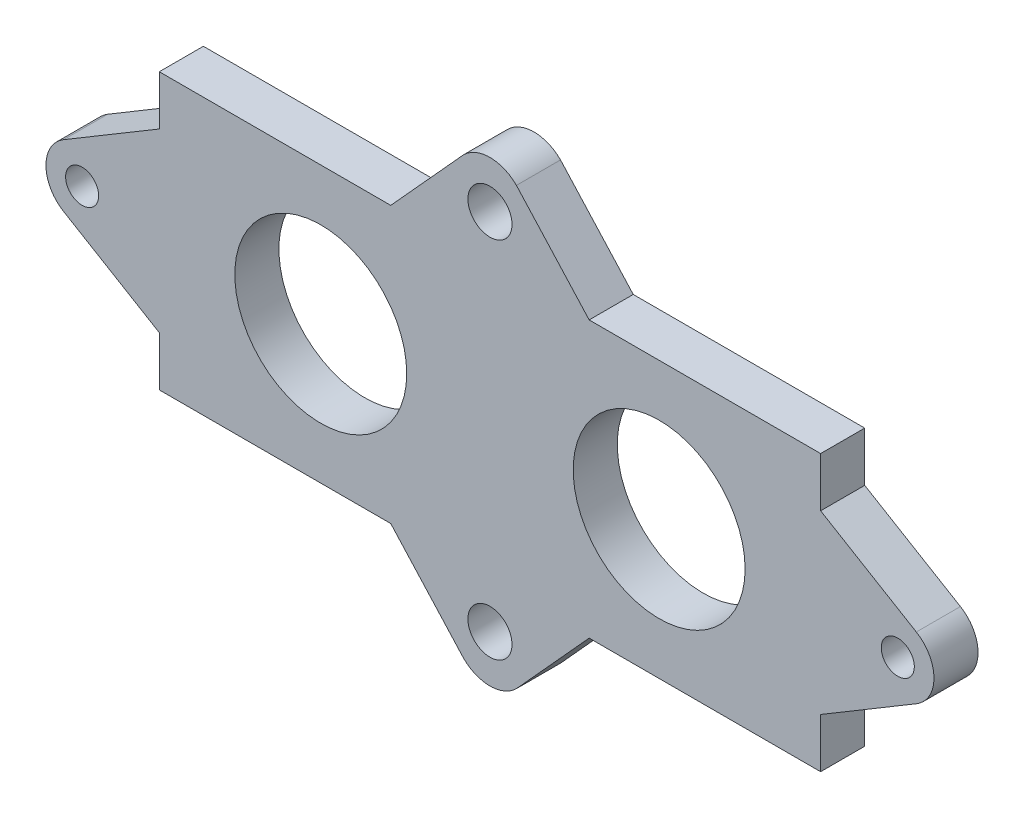
ISO-10303-21;
HEADER;
FILE_DESCRIPTION(('STEP AP214'),'2;1');
FILE_NAME('part.step','',(''),(''),'','','');
FILE_SCHEMA(('AUTOMOTIVE_DESIGN { 1 0 10303 214 1 1 1 1 }'));
ENDSEC;
DATA;
#1=APPLICATION_CONTEXT('core data for automotive mechanical design processes');
#2=APPLICATION_PROTOCOL_DEFINITION('international standard','automotive_design',2000,#1);
#3=PRODUCT_CONTEXT('',#1,'mechanical');
#4=PRODUCT('Part','Part','',(#3));
#5=PRODUCT_RELATED_PRODUCT_CATEGORY('part','',(#4));
#6=PRODUCT_DEFINITION_FORMATION('','',#4);
#7=PRODUCT_DEFINITION_CONTEXT('part definition',#1,'design');
#8=PRODUCT_DEFINITION('design','',#6,#7);
#9=PRODUCT_DEFINITION_SHAPE('','',#8);
#10=(LENGTH_UNIT() NAMED_UNIT(*) SI_UNIT(.MILLI.,.METRE.));
#11=(NAMED_UNIT(*) PLANE_ANGLE_UNIT() SI_UNIT($,.RADIAN.));
#12=(NAMED_UNIT(*) SI_UNIT($,.STERADIAN.) SOLID_ANGLE_UNIT());
#13=UNCERTAINTY_MEASURE_WITH_UNIT(LENGTH_MEASURE(1.E-05),#10,'distance_accuracy_value','');
#14=(GEOMETRIC_REPRESENTATION_CONTEXT(3) GLOBAL_UNCERTAINTY_ASSIGNED_CONTEXT((#13)) GLOBAL_UNIT_ASSIGNED_CONTEXT((#10,
#11,#12)) REPRESENTATION_CONTEXT('',''));
#15=CARTESIAN_POINT('',(0.,0.,0.));
#16=DIRECTION('',(0.,0.,1.));
#17=DIRECTION('',(1.,0.,0.));
#18=AXIS2_PLACEMENT_3D('',#15,#16,#17);
#19=CARTESIAN_POINT('',(-37.,0.,4.));
#20=DIRECTION('',(0.,0.,-1.));
#21=DIRECTION('',(-1.,0.,0.));
#22=AXIS2_PLACEMENT_3D('',#19,#20,#21);
#23=PLANE('',#22);
#24=DIRECTION('',(0.,-1.,0.));
#25=VECTOR('',#24,1.);
#26=CARTESIAN_POINT('',(-30.,12.5,4.));
#27=LINE('',#26,#25);
#28=CARTESIAN_POINT('',(-30.,12.5,4.));
#29=VERTEX_POINT('',#28);
#30=CARTESIAN_POINT('',(-30.,8.,4.));
#31=VERTEX_POINT('',#30);
#32=EDGE_CURVE('E242',#29,#31,#27,.T.);
#33=ORIENTED_EDGE('',*,*,#32,.T.);
#34=DIRECTION('',(-0.858790826671179,-0.512326376468588,0.));
#35=VECTOR('',#34,1.);
#36=CARTESIAN_POINT('',(-38.6825013268052,2.82030512518618,4.));
#37=LINE('',#36,#35);
#38=CARTESIAN_POINT('',(-38.6825013268052,2.82030512518618,4.));
#39=VERTEX_POINT('',#38);
#40=EDGE_CURVE('E130',#31,#39,#37,.T.);
#41=ORIENTED_EDGE('',*,*,#40,.T.);
#42=CARTESIAN_POINT('',(-37.,0.,4.));
#43=DIRECTION('',(0.,0.,1.));
#44=DIRECTION('',(-1.,0.,0.));
#45=AXIS2_PLACEMENT_3D('',#42,#43,#44);
#46=CIRCLE('',#45,3.28404197808932);
#47=CARTESIAN_POINT('',(-38.6825013268052,-2.82030512518618,4.));
#48=VERTEX_POINT('',#47);
#49=EDGE_CURVE('E293',#39,#48,#46,.T.);
#50=ORIENTED_EDGE('',*,*,#49,.T.);
#51=DIRECTION('',(0.858790826671179,-0.512326376468588,0.));
#52=VECTOR('',#51,1.);
#53=CARTESIAN_POINT('',(-30.,-8.,4.));
#54=LINE('',#53,#52);
#55=CARTESIAN_POINT('',(-30.,-8.,4.));
#56=VERTEX_POINT('',#55);
#57=EDGE_CURVE('E312',#48,#56,#54,.T.);
#58=ORIENTED_EDGE('',*,*,#57,.T.);
#59=DIRECTION('',(0.,-1.,0.));
#60=VECTOR('',#59,1.);
#61=CARTESIAN_POINT('',(-30.,-8.,4.));
#62=LINE('',#61,#60);
#63=CARTESIAN_POINT('',(-30.,-12.5,4.));
#64=VERTEX_POINT('',#63);
#65=EDGE_CURVE('E309',#56,#64,#62,.T.);
#66=ORIENTED_EDGE('',*,*,#65,.T.);
#67=DIRECTION('',(1.,0.,0.));
#68=VECTOR('',#67,1.);
#69=CARTESIAN_POINT('',(-30.,-12.5,4.));
#70=LINE('',#69,#68);
#71=CARTESIAN_POINT('',(-9.,-12.5,4.));
#72=VERTEX_POINT('',#71);
#73=EDGE_CURVE('E311',#64,#72,#70,.T.);
#74=ORIENTED_EDGE('',*,*,#73,.T.);
#75=DIRECTION('',(0.671988671110962,-0.740561426148111,0.));
#76=VECTOR('',#75,1.);
#77=CARTESIAN_POINT('',(-9.,-12.5,4.));
#78=LINE('',#77,#76);
#79=CARTESIAN_POINT('',(-2.4010102843855,-19.772380391254,4.));
#80=VERTEX_POINT('',#79);
#81=EDGE_CURVE('E314',#72,#80,#78,.T.);
#82=ORIENTED_EDGE('',*,*,#81,.T.);
#83=CARTESIAN_POINT('',(0.,-17.3713701068685,4.));
#84=DIRECTION('',(0.,0.,1.));
#85=DIRECTION('',(1.,0.,0.));
#86=AXIS2_PLACEMENT_3D('',#83,#84,#85);
#87=CIRCLE('',#86,3.39554130757526);
#88=CARTESIAN_POINT('',(2.4010102843855,-19.772380391254,4.));
#89=VERTEX_POINT('',#88);
#90=EDGE_CURVE('E320',#80,#89,#87,.T.);
#91=ORIENTED_EDGE('',*,*,#90,.T.);
#92=DIRECTION('',(0.671988671110962,0.740561426148111,0.));
#93=VECTOR('',#92,1.);
#94=CARTESIAN_POINT('',(2.4010102843855,-19.772380391254,4.));
#95=LINE('',#94,#93);
#96=CARTESIAN_POINT('',(9.,-12.5,4.));
#97=VERTEX_POINT('',#96);
#98=EDGE_CURVE('E322',#89,#97,#95,.T.);
#99=ORIENTED_EDGE('',*,*,#98,.T.);
#100=DIRECTION('',(1.,0.,0.));
#101=VECTOR('',#100,1.);
#102=CARTESIAN_POINT('',(9.,-12.5,4.));
#103=LINE('',#102,#101);
#104=CARTESIAN_POINT('',(30.,-12.5,4.));
#105=VERTEX_POINT('',#104);
#106=EDGE_CURVE('E324',#97,#105,#103,.T.);
#107=ORIENTED_EDGE('',*,*,#106,.T.);
#108=DIRECTION('',(0.,1.,0.));
#109=VECTOR('',#108,1.);
#110=CARTESIAN_POINT('',(30.,-8.,4.));
#111=LINE('',#110,#109);
#112=CARTESIAN_POINT('',(30.,-8.,4.));
#113=VERTEX_POINT('',#112);
#114=EDGE_CURVE('E326',#105,#113,#111,.T.);
#115=ORIENTED_EDGE('',*,*,#114,.T.);
#116=DIRECTION('',(0.858790826671179,0.512326376468588,0.));
#117=VECTOR('',#116,1.);
#118=CARTESIAN_POINT('',(30.,-8.,4.));
#119=LINE('',#118,#117);
#120=CARTESIAN_POINT('',(38.6825013268052,-2.82030512518618,4.));
#121=VERTEX_POINT('',#120);
#122=EDGE_CURVE('E328',#113,#121,#119,.T.);
#123=ORIENTED_EDGE('',*,*,#122,.T.);
#124=CARTESIAN_POINT('',(37.,0.,4.));
#125=DIRECTION('',(0.,0.,1.));
#126=DIRECTION('',(1.,0.,0.));
#127=AXIS2_PLACEMENT_3D('',#124,#125,#126);
#128=CIRCLE('',#127,3.28404197808932);
#129=CARTESIAN_POINT('',(38.6825013268052,2.82030512518618,4.));
#130=VERTEX_POINT('',#129);
#131=EDGE_CURVE('E330',#121,#130,#128,.T.);
#132=ORIENTED_EDGE('',*,*,#131,.T.);
#133=DIRECTION('',(-0.858790826671179,0.512326376468588,0.));
#134=VECTOR('',#133,1.);
#135=CARTESIAN_POINT('',(38.6825013268052,2.82030512518618,4.));
#136=LINE('',#135,#134);
#137=CARTESIAN_POINT('',(30.,8.,4.));
#138=VERTEX_POINT('',#137);
#139=EDGE_CURVE('E332',#130,#138,#136,.T.);
#140=ORIENTED_EDGE('',*,*,#139,.T.);
#141=DIRECTION('',(0.,1.,0.));
#142=VECTOR('',#141,1.);
#143=CARTESIAN_POINT('',(30.,12.5,4.));
#144=LINE('',#143,#142);
#145=CARTESIAN_POINT('',(30.,12.5,4.));
#146=VERTEX_POINT('',#145);
#147=EDGE_CURVE('E334',#138,#146,#144,.T.);
#148=ORIENTED_EDGE('',*,*,#147,.T.);
#149=DIRECTION('',(-1.,0.,0.));
#150=VECTOR('',#149,1.);
#151=CARTESIAN_POINT('',(9.,12.5,4.));
#152=LINE('',#151,#150);
#153=CARTESIAN_POINT('',(9.,12.5,4.));
#154=VERTEX_POINT('',#153);
#155=EDGE_CURVE('E336',#146,#154,#152,.T.);
#156=ORIENTED_EDGE('',*,*,#155,.T.);
#157=DIRECTION('',(-0.671988671110962,0.740561426148111,0.));
#158=VECTOR('',#157,1.);
#159=CARTESIAN_POINT('',(2.4010102843855,19.772380391254,4.));
#160=LINE('',#159,#158);
#161=CARTESIAN_POINT('',(2.4010102843855,19.772380391254,4.));
#162=VERTEX_POINT('',#161);
#163=EDGE_CURVE('E185',#154,#162,#160,.T.);
#164=ORIENTED_EDGE('',*,*,#163,.T.);
#165=CARTESIAN_POINT('',(0.,17.3713701068685,4.));
#166=DIRECTION('',(0.,0.,1.));
#167=DIRECTION('',(-1.,0.,0.));
#168=AXIS2_PLACEMENT_3D('',#165,#166,#167);
#169=CIRCLE('',#168,3.39554130757526);
#170=CARTESIAN_POINT('',(-2.4010102843855,19.772380391254,4.));
#171=VERTEX_POINT('',#170);
#172=EDGE_CURVE('E179',#162,#171,#169,.T.);
#173=ORIENTED_EDGE('',*,*,#172,.T.);
#174=DIRECTION('',(-0.671988671110962,-0.740561426148111,0.));
#175=VECTOR('',#174,1.);
#176=CARTESIAN_POINT('',(-9.,12.5,4.));
#177=LINE('',#176,#175);
#178=CARTESIAN_POINT('',(-9.,12.5,4.));
#179=VERTEX_POINT('',#178);
#180=EDGE_CURVE('E183',#171,#179,#177,.T.);
#181=ORIENTED_EDGE('',*,*,#180,.T.);
#182=DIRECTION('',(-1.,0.,0.));
#183=VECTOR('',#182,1.);
#184=CARTESIAN_POINT('',(-30.,12.5,4.));
#185=LINE('',#184,#183);
#186=EDGE_CURVE('E51',#179,#29,#185,.T.);
#187=ORIENTED_EDGE('',*,*,#186,.T.);
#188=EDGE_LOOP('',(#33,#41,#50,#58,#66,#74,#82,#91,#99,#107,#115,#123,#132,#140,#148,#156,#164,
#173,#181,#187));
#189=FACE_BOUND('',#188,.T.);
#190=CARTESIAN_POINT('',(-15.35,0.,4.));
#191=DIRECTION('',(0.,0.,1.));
#192=DIRECTION('',(1.,0.,0.));
#193=AXIS2_PLACEMENT_3D('',#190,#191,#192);
#194=CIRCLE('',#193,7.8);
#195=CARTESIAN_POINT('',(-7.55,0.,4.));
#196=VERTEX_POINT('',#195);
#197=EDGE_CURVE('E207',#196,#196,#194,.T.);
#198=ORIENTED_EDGE('',*,*,#197,.F.);
#199=EDGE_LOOP('',(#198));
#200=FACE_BOUND('',#199,.T.);
#201=CARTESIAN_POINT('',(15.35,0.,4.));
#202=DIRECTION('',(0.,0.,1.));
#203=DIRECTION('',(1.,0.,0.));
#204=AXIS2_PLACEMENT_3D('',#201,#202,#203);
#205=CIRCLE('',#204,7.80000000000001);
#206=CARTESIAN_POINT('',(23.15,0.,4.));
#207=VERTEX_POINT('',#206);
#208=EDGE_CURVE('E420',#207,#207,#205,.T.);
#209=ORIENTED_EDGE('',*,*,#208,.F.);
#210=EDGE_LOOP('',(#209));
#211=FACE_BOUND('',#210,.T.);
#212=CARTESIAN_POINT('',(0.,16.5,4.));
#213=DIRECTION('',(0.,0.,1.));
#214=DIRECTION('',(1.,0.,0.));
#215=AXIS2_PLACEMENT_3D('',#212,#213,#214);
#216=CIRCLE('',#215,2.);
#217=CARTESIAN_POINT('',(2.,16.5,4.));
#218=VERTEX_POINT('',#217);
#219=EDGE_CURVE('E414',#218,#218,#216,.T.);
#220=ORIENTED_EDGE('',*,*,#219,.F.);
#221=EDGE_LOOP('',(#220));
#222=FACE_BOUND('',#221,.T.);
#223=CARTESIAN_POINT('',(0.,-16.5,4.));
#224=DIRECTION('',(0.,0.,1.));
#225=DIRECTION('',(-1.,0.,0.));
#226=AXIS2_PLACEMENT_3D('',#223,#224,#225);
#227=CIRCLE('',#226,2.);
#228=CARTESIAN_POINT('',(-2.,-16.5,4.));
#229=VERTEX_POINT('',#228);
#230=EDGE_CURVE('E408',#229,#229,#227,.T.);
#231=ORIENTED_EDGE('',*,*,#230,.F.);
#232=EDGE_LOOP('',(#231));
#233=FACE_BOUND('',#232,.T.);
#234=CARTESIAN_POINT('',(-37.,0.,4.));
#235=DIRECTION('',(0.,0.,1.));
#236=DIRECTION('',(1.,0.,0.));
#237=AXIS2_PLACEMENT_3D('',#234,#235,#236);
#238=CIRCLE('',#237,1.5);
#239=CARTESIAN_POINT('',(-35.5,0.,4.));
#240=VERTEX_POINT('',#239);
#241=EDGE_CURVE('E402',#240,#240,#238,.T.);
#242=ORIENTED_EDGE('',*,*,#241,.F.);
#243=EDGE_LOOP('',(#242));
#244=FACE_BOUND('',#243,.T.);
#245=CARTESIAN_POINT('',(37.,0.,4.));
#246=DIRECTION('',(0.,0.,1.));
#247=DIRECTION('',(-1.,0.,0.));
#248=AXIS2_PLACEMENT_3D('',#245,#246,#247);
#249=CIRCLE('',#248,1.5);
#250=CARTESIAN_POINT('',(35.5,0.,4.));
#251=VERTEX_POINT('',#250);
#252=EDGE_CURVE('E393',#251,#251,#249,.T.);
#253=ORIENTED_EDGE('',*,*,#252,.F.);
#254=EDGE_LOOP('',(#253));
#255=FACE_BOUND('',#254,.T.);
#256=ADVANCED_FACE('F34',(#189,#200,#211,#222,#233,#244,#255),#23,.F.);
#257=CARTESIAN_POINT('',(-37.,0.,0.));
#258=DIRECTION('',(0.,0.,-1.));
#259=DIRECTION('',(-1.,0.,0.));
#260=AXIS2_PLACEMENT_3D('',#257,#258,#259);
#261=PLANE('',#260);
#262=CARTESIAN_POINT('',(-37.,0.,0.));
#263=DIRECTION('',(0.,0.,1.));
#264=DIRECTION('',(1.,0.,0.));
#265=AXIS2_PLACEMENT_3D('',#262,#263,#264);
#266=CIRCLE('',#265,1.5);
#267=CARTESIAN_POINT('',(-35.5,0.,0.));
#268=VERTEX_POINT('',#267);
#269=EDGE_CURVE('E399',#268,#268,#266,.T.);
#270=ORIENTED_EDGE('',*,*,#269,.T.);
#271=EDGE_LOOP('',(#270));
#272=FACE_BOUND('',#271,.T.);
#273=CARTESIAN_POINT('',(0.,16.5,0.));
#274=DIRECTION('',(0.,0.,1.));
#275=DIRECTION('',(1.,0.,0.));
#276=AXIS2_PLACEMENT_3D('',#273,#274,#275);
#277=CIRCLE('',#276,2.);
#278=CARTESIAN_POINT('',(2.,16.5,0.));
#279=VERTEX_POINT('',#278);
#280=EDGE_CURVE('E411',#279,#279,#277,.T.);
#281=ORIENTED_EDGE('',*,*,#280,.T.);
#282=EDGE_LOOP('',(#281));
#283=FACE_BOUND('',#282,.T.);
#284=CARTESIAN_POINT('',(-15.35,0.,0.));
#285=DIRECTION('',(0.,0.,1.));
#286=DIRECTION('',(1.,0.,0.));
#287=AXIS2_PLACEMENT_3D('',#284,#285,#286);
#288=CIRCLE('',#287,7.8);
#289=CARTESIAN_POINT('',(-7.55,0.,0.));
#290=VERTEX_POINT('',#289);
#291=EDGE_CURVE('E423',#290,#290,#288,.T.);
#292=ORIENTED_EDGE('',*,*,#291,.T.);
#293=EDGE_LOOP('',(#292));
#294=FACE_BOUND('',#293,.T.);
#295=DIRECTION('',(0.,-1.,0.));
#296=VECTOR('',#295,1.);
#297=CARTESIAN_POINT('',(-30.,12.5,0.));
#298=LINE('',#297,#296);
#299=CARTESIAN_POINT('',(-30.,12.5,0.));
#300=VERTEX_POINT('',#299);
#301=CARTESIAN_POINT('',(-30.,8.,0.));
#302=VERTEX_POINT('',#301);
#303=EDGE_CURVE('E203',#300,#302,#298,.T.);
#304=ORIENTED_EDGE('',*,*,#303,.F.);
#305=DIRECTION('',(-1.,0.,0.));
#306=VECTOR('',#305,1.);
#307=CARTESIAN_POINT('',(-30.,12.5,0.));
#308=LINE('',#307,#306);
#309=CARTESIAN_POINT('',(-9.,12.5,0.));
#310=VERTEX_POINT('',#309);
#311=EDGE_CURVE('E122',#310,#300,#308,.T.);
#312=ORIENTED_EDGE('',*,*,#311,.F.);
#313=DIRECTION('',(-0.671988671110962,-0.740561426148111,0.));
#314=VECTOR('',#313,1.);
#315=CARTESIAN_POINT('',(-9.,12.5,0.));
#316=LINE('',#315,#314);
#317=CARTESIAN_POINT('',(-2.4010102843855,19.772380391254,0.));
#318=VERTEX_POINT('',#317);
#319=EDGE_CURVE('E116',#318,#310,#316,.T.);
#320=ORIENTED_EDGE('',*,*,#319,.F.);
#321=CARTESIAN_POINT('',(0.,17.3713701068685,0.));
#322=DIRECTION('',(0.,0.,1.));
#323=DIRECTION('',(-1.,0.,0.));
#324=AXIS2_PLACEMENT_3D('',#321,#322,#323);
#325=CIRCLE('',#324,3.39554130757526);
#326=CARTESIAN_POINT('',(2.4010102843855,19.772380391254,0.));
#327=VERTEX_POINT('',#326);
#328=EDGE_CURVE('E193',#327,#318,#325,.T.);
#329=ORIENTED_EDGE('',*,*,#328,.F.);
#330=DIRECTION('',(-0.671988671110962,0.740561426148111,0.));
#331=VECTOR('',#330,1.);
#332=CARTESIAN_POINT('',(2.4010102843855,19.772380391254,0.));
#333=LINE('',#332,#331);
#334=CARTESIAN_POINT('',(9.,12.5,0.));
#335=VERTEX_POINT('',#334);
#336=EDGE_CURVE('E237',#335,#327,#333,.T.);
#337=ORIENTED_EDGE('',*,*,#336,.F.);
#338=DIRECTION('',(-1.,0.,0.));
#339=VECTOR('',#338,1.);
#340=CARTESIAN_POINT('',(9.,12.5,0.));
#341=LINE('',#340,#339);
#342=CARTESIAN_POINT('',(30.,12.5,0.));
#343=VERTEX_POINT('',#342);
#344=EDGE_CURVE('E235',#343,#335,#341,.T.);
#345=ORIENTED_EDGE('',*,*,#344,.F.);
#346=DIRECTION('',(0.,1.,0.));
#347=VECTOR('',#346,1.);
#348=CARTESIAN_POINT('',(30.,12.5,0.));
#349=LINE('',#348,#347);
#350=CARTESIAN_POINT('',(30.,8.,0.));
#351=VERTEX_POINT('',#350);
#352=EDGE_CURVE('E233',#351,#343,#349,.T.);
#353=ORIENTED_EDGE('',*,*,#352,.F.);
#354=DIRECTION('',(-0.858790826671179,0.512326376468588,0.));
#355=VECTOR('',#354,1.);
#356=CARTESIAN_POINT('',(38.6825013268052,2.82030512518618,0.));
#357=LINE('',#356,#355);
#358=CARTESIAN_POINT('',(38.6825013268052,2.82030512518618,0.));
#359=VERTEX_POINT('',#358);
#360=EDGE_CURVE('E231',#359,#351,#357,.T.);
#361=ORIENTED_EDGE('',*,*,#360,.F.);
#362=CARTESIAN_POINT('',(37.,0.,0.));
#363=DIRECTION('',(0.,0.,1.));
#364=DIRECTION('',(1.,0.,0.));
#365=AXIS2_PLACEMENT_3D('',#362,#363,#364);
#366=CIRCLE('',#365,3.28404197808932);
#367=CARTESIAN_POINT('',(38.6825013268052,-2.82030512518618,0.));
#368=VERTEX_POINT('',#367);
#369=EDGE_CURVE('E229',#368,#359,#366,.T.);
#370=ORIENTED_EDGE('',*,*,#369,.F.);
#371=DIRECTION('',(0.858790826671179,0.512326376468588,0.));
#372=VECTOR('',#371,1.);
#373=CARTESIAN_POINT('',(30.,-8.,0.));
#374=LINE('',#373,#372);
#375=CARTESIAN_POINT('',(30.,-8.,0.));
#376=VERTEX_POINT('',#375);
#377=EDGE_CURVE('E227',#376,#368,#374,.T.);
#378=ORIENTED_EDGE('',*,*,#377,.F.);
#379=DIRECTION('',(0.,1.,0.));
#380=VECTOR('',#379,1.);
#381=CARTESIAN_POINT('',(30.,-8.,0.));
#382=LINE('',#381,#380);
#383=CARTESIAN_POINT('',(30.,-12.5,0.));
#384=VERTEX_POINT('',#383);
#385=EDGE_CURVE('E225',#384,#376,#382,.T.);
#386=ORIENTED_EDGE('',*,*,#385,.F.);
#387=DIRECTION('',(1.,0.,0.));
#388=VECTOR('',#387,1.);
#389=CARTESIAN_POINT('',(9.,-12.5,0.));
#390=LINE('',#389,#388);
#391=CARTESIAN_POINT('',(9.,-12.5,0.));
#392=VERTEX_POINT('',#391);
#393=EDGE_CURVE('E223',#392,#384,#390,.T.);
#394=ORIENTED_EDGE('',*,*,#393,.F.);
#395=DIRECTION('',(0.671988671110962,0.740561426148111,0.));
#396=VECTOR('',#395,1.);
#397=CARTESIAN_POINT('',(2.4010102843855,-19.772380391254,0.));
#398=LINE('',#397,#396);
#399=CARTESIAN_POINT('',(2.4010102843855,-19.772380391254,0.));
#400=VERTEX_POINT('',#399);
#401=EDGE_CURVE('E221',#400,#392,#398,.T.);
#402=ORIENTED_EDGE('',*,*,#401,.F.);
#403=CARTESIAN_POINT('',(0.,-17.3713701068685,0.));
#404=DIRECTION('',(0.,0.,1.));
#405=DIRECTION('',(1.,0.,0.));
#406=AXIS2_PLACEMENT_3D('',#403,#404,#405);
#407=CIRCLE('',#406,3.39554130757526);
#408=CARTESIAN_POINT('',(-2.4010102843855,-19.772380391254,0.));
#409=VERTEX_POINT('',#408);
#410=EDGE_CURVE('E219',#409,#400,#407,.T.);
#411=ORIENTED_EDGE('',*,*,#410,.F.);
#412=DIRECTION('',(0.671988671110962,-0.740561426148111,0.));
#413=VECTOR('',#412,1.);
#414=CARTESIAN_POINT('',(-9.,-12.5,0.));
#415=LINE('',#414,#413);
#416=CARTESIAN_POINT('',(-9.,-12.5,0.));
#417=VERTEX_POINT('',#416);
#418=EDGE_CURVE('E217',#417,#409,#415,.T.);
#419=ORIENTED_EDGE('',*,*,#418,.F.);
#420=DIRECTION('',(1.,0.,0.));
#421=VECTOR('',#420,1.);
#422=CARTESIAN_POINT('',(-30.,-12.5,0.));
#423=LINE('',#422,#421);
#424=CARTESIAN_POINT('',(-30.,-12.5,0.));
#425=VERTEX_POINT('',#424);
#426=EDGE_CURVE('E215',#425,#417,#423,.T.);
#427=ORIENTED_EDGE('',*,*,#426,.F.);
#428=DIRECTION('',(0.,-1.,0.));
#429=VECTOR('',#428,1.);
#430=CARTESIAN_POINT('',(-30.,-8.,0.));
#431=LINE('',#430,#429);
#432=CARTESIAN_POINT('',(-30.,-8.,0.));
#433=VERTEX_POINT('',#432);
#434=EDGE_CURVE('E213',#433,#425,#431,.T.);
#435=ORIENTED_EDGE('',*,*,#434,.F.);
#436=DIRECTION('',(0.858790826671179,-0.512326376468588,0.));
#437=VECTOR('',#436,1.);
#438=CARTESIAN_POINT('',(-30.,-8.,0.));
#439=LINE('',#438,#437);
#440=CARTESIAN_POINT('',(-38.6825013268052,-2.82030512518618,0.));
#441=VERTEX_POINT('',#440);
#442=EDGE_CURVE('E211',#441,#433,#439,.T.);
#443=ORIENTED_EDGE('',*,*,#442,.F.);
#444=CARTESIAN_POINT('',(-37.,0.,0.));
#445=DIRECTION('',(0.,0.,1.));
#446=DIRECTION('',(-1.,0.,0.));
#447=AXIS2_PLACEMENT_3D('',#444,#445,#446);
#448=CIRCLE('',#447,3.28404197808932);
#449=CARTESIAN_POINT('',(-38.6825013268052,2.82030512518618,0.));
#450=VERTEX_POINT('',#449);
#451=EDGE_CURVE('E209',#450,#441,#448,.T.);
#452=ORIENTED_EDGE('',*,*,#451,.F.);
#453=DIRECTION('',(-0.858790826671179,-0.512326376468588,0.));
#454=VECTOR('',#453,1.);
#455=CARTESIAN_POINT('',(-38.6825013268052,2.82030512518618,0.));
#456=LINE('',#455,#454);
#457=EDGE_CURVE('E206',#302,#450,#456,.T.);
#458=ORIENTED_EDGE('',*,*,#457,.F.);
#459=EDGE_LOOP('',(#304,#312,#320,#329,#337,#345,#353,#361,#370,#378,#386,#394,#402,#411,#419,
#427,#435,#443,#452,#458));
#460=FACE_BOUND('',#459,.T.);
#461=CARTESIAN_POINT('',(15.35,0.,0.));
#462=DIRECTION('',(0.,0.,1.));
#463=DIRECTION('',(1.,0.,0.));
#464=AXIS2_PLACEMENT_3D('',#461,#462,#463);
#465=CIRCLE('',#464,7.80000000000001);
#466=CARTESIAN_POINT('',(23.15,0.,0.));
#467=VERTEX_POINT('',#466);
#468=EDGE_CURVE('E417',#467,#467,#465,.T.);
#469=ORIENTED_EDGE('',*,*,#468,.T.);
#470=EDGE_LOOP('',(#469));
#471=FACE_BOUND('',#470,.T.);
#472=CARTESIAN_POINT('',(0.,-16.5,0.));
#473=DIRECTION('',(0.,0.,1.));
#474=DIRECTION('',(-1.,0.,0.));
#475=AXIS2_PLACEMENT_3D('',#472,#473,#474);
#476=CIRCLE('',#475,2.);
#477=CARTESIAN_POINT('',(-2.,-16.5,0.));
#478=VERTEX_POINT('',#477);
#479=EDGE_CURVE('E405',#478,#478,#476,.T.);
#480=ORIENTED_EDGE('',*,*,#479,.T.);
#481=EDGE_LOOP('',(#480));
#482=FACE_BOUND('',#481,.T.);
#483=CARTESIAN_POINT('',(37.,0.,0.));
#484=DIRECTION('',(0.,0.,1.));
#485=DIRECTION('',(-1.,0.,0.));
#486=AXIS2_PLACEMENT_3D('',#483,#484,#485);
#487=CIRCLE('',#486,1.5);
#488=CARTESIAN_POINT('',(35.5,0.,0.));
#489=VERTEX_POINT('',#488);
#490=EDGE_CURVE('E396',#489,#489,#487,.T.);
#491=ORIENTED_EDGE('',*,*,#490,.T.);
#492=EDGE_LOOP('',(#491));
#493=FACE_BOUND('',#492,.T.);
#494=ADVANCED_FACE('F297',(#272,#283,#294,#460,#471,#482,#493),#261,.T.);
#495=CARTESIAN_POINT('',(-30.,12.5,4.));
#496=DIRECTION('',(1.,0.,0.));
#497=DIRECTION('',(0.,0.,-1.));
#498=AXIS2_PLACEMENT_3D('',#495,#496,#497);
#499=PLANE('',#498);
#500=ORIENTED_EDGE('',*,*,#303,.T.);
#501=DIRECTION('',(0.,0.,-1.));
#502=VECTOR('',#501,1.);
#503=CARTESIAN_POINT('',(-30.,8.,4.));
#504=LINE('',#503,#502);
#505=EDGE_CURVE('E11',#31,#302,#504,.T.);
#506=ORIENTED_EDGE('',*,*,#505,.F.);
#507=ORIENTED_EDGE('',*,*,#32,.F.);
#508=DIRECTION('',(0.,0.,-1.));
#509=VECTOR('',#508,1.);
#510=CARTESIAN_POINT('',(-30.,12.5,4.));
#511=LINE('',#510,#509);
#512=EDGE_CURVE('E199',#29,#300,#511,.T.);
#513=ORIENTED_EDGE('',*,*,#512,.T.);
#514=EDGE_LOOP('',(#500,#506,#507,#513));
#515=FACE_BOUND('',#514,.T.);
#516=ADVANCED_FACE('F36',(#515),#499,.F.);
#517=CARTESIAN_POINT('',(-38.6825013268052,2.82030512518618,4.));
#518=DIRECTION('',(0.512326376468588,-0.858790826671179,0.));
#519=DIRECTION('',(0.858790826671179,0.512326376468588,0.));
#520=AXIS2_PLACEMENT_3D('',#517,#518,#519);
#521=PLANE('',#520);
#522=ORIENTED_EDGE('',*,*,#457,.T.);
#523=DIRECTION('',(0.,0.,-1.));
#524=VECTOR('',#523,1.);
#525=CARTESIAN_POINT('',(-38.6825013268052,2.82030512518618,4.));
#526=LINE('',#525,#524);
#527=EDGE_CURVE('E43',#39,#450,#526,.T.);
#528=ORIENTED_EDGE('',*,*,#527,.F.);
#529=ORIENTED_EDGE('',*,*,#40,.F.);
#530=ORIENTED_EDGE('',*,*,#505,.T.);
#531=EDGE_LOOP('',(#522,#528,#529,#530));
#532=FACE_BOUND('',#531,.T.);
#533=ADVANCED_FACE('F633',(#532),#521,.F.);
#534=CARTESIAN_POINT('',(-37.,0.,4.));
#535=DIRECTION('',(0.,0.,-1.));
#536=DIRECTION('',(-1.,0.,0.));
#537=AXIS2_PLACEMENT_3D('',#534,#535,#536);
#538=CYLINDRICAL_SURFACE('',#537,3.28404197808932);
#539=ORIENTED_EDGE('',*,*,#451,.T.);
#540=DIRECTION('',(0.,0.,-1.));
#541=VECTOR('',#540,1.);
#542=CARTESIAN_POINT('',(-38.6825013268052,-2.82030512518618,4.));
#543=LINE('',#542,#541);
#544=EDGE_CURVE('E285',#48,#441,#543,.T.);
#545=ORIENTED_EDGE('',*,*,#544,.F.);
#546=ORIENTED_EDGE('',*,*,#49,.F.);
#547=ORIENTED_EDGE('',*,*,#527,.T.);
#548=EDGE_LOOP('',(#539,#545,#546,#547));
#549=FACE_BOUND('',#548,.T.);
#550=ADVANCED_FACE('F291',(#549),#538,.T.);
#551=CARTESIAN_POINT('',(-30.,-8.,4.));
#552=DIRECTION('',(0.512326376468588,0.858790826671179,0.));
#553=DIRECTION('',(-0.858790826671179,0.512326376468588,0.));
#554=AXIS2_PLACEMENT_3D('',#551,#552,#553);
#555=PLANE('',#554);
#556=ORIENTED_EDGE('',*,*,#442,.T.);
#557=DIRECTION('',(0.,0.,-1.));
#558=VECTOR('',#557,1.);
#559=CARTESIAN_POINT('',(-30.,-8.,4.));
#560=LINE('',#559,#558);
#561=EDGE_CURVE('E282',#56,#433,#560,.T.);
#562=ORIENTED_EDGE('',*,*,#561,.F.);
#563=ORIENTED_EDGE('',*,*,#57,.F.);
#564=ORIENTED_EDGE('',*,*,#544,.T.);
#565=EDGE_LOOP('',(#556,#562,#563,#564));
#566=FACE_BOUND('',#565,.T.);
#567=ADVANCED_FACE('F303',(#566),#555,.F.);
#568=CARTESIAN_POINT('',(-30.,-8.,4.));
#569=DIRECTION('',(1.,0.,0.));
#570=DIRECTION('',(0.,1.,0.));
#571=AXIS2_PLACEMENT_3D('',#568,#569,#570);
#572=PLANE('',#571);
#573=ORIENTED_EDGE('',*,*,#434,.T.);
#574=DIRECTION('',(0.,0.,-1.));
#575=VECTOR('',#574,1.);
#576=CARTESIAN_POINT('',(-30.,-12.5,4.));
#577=LINE('',#576,#575);
#578=EDGE_CURVE('E279',#64,#425,#577,.T.);
#579=ORIENTED_EDGE('',*,*,#578,.F.);
#580=ORIENTED_EDGE('',*,*,#65,.F.);
#581=ORIENTED_EDGE('',*,*,#561,.T.);
#582=EDGE_LOOP('',(#573,#579,#580,#581));
#583=FACE_BOUND('',#582,.T.);
#584=ADVANCED_FACE('F307',(#583),#572,.F.);
#585=CARTESIAN_POINT('',(-30.,-12.5,4.));
#586=DIRECTION('',(0.,1.,0.));
#587=DIRECTION('',(0.,0.,1.));
#588=AXIS2_PLACEMENT_3D('',#585,#586,#587);
#589=PLANE('',#588);
#590=ORIENTED_EDGE('',*,*,#426,.T.);
#591=DIRECTION('',(0.,0.,-1.));
#592=VECTOR('',#591,1.);
#593=CARTESIAN_POINT('',(-9.,-12.5,4.));
#594=LINE('',#593,#592);
#595=EDGE_CURVE('E276',#72,#417,#594,.T.);
#596=ORIENTED_EDGE('',*,*,#595,.F.);
#597=ORIENTED_EDGE('',*,*,#73,.F.);
#598=ORIENTED_EDGE('',*,*,#578,.T.);
#599=EDGE_LOOP('',(#590,#596,#597,#598));
#600=FACE_BOUND('',#599,.T.);
#601=ADVANCED_FACE('F598',(#600),#589,.F.);
#602=CARTESIAN_POINT('',(-9.,-12.5,4.));
#603=DIRECTION('',(0.740561426148111,0.671988671110962,0.));
#604=DIRECTION('',(-0.671988671110962,0.740561426148111,0.));
#605=AXIS2_PLACEMENT_3D('',#602,#603,#604);
#606=PLANE('',#605);
#607=ORIENTED_EDGE('',*,*,#418,.T.);
#608=DIRECTION('',(0.,0.,-1.));
#609=VECTOR('',#608,1.);
#610=CARTESIAN_POINT('',(-2.4010102843855,-19.772380391254,4.));
#611=LINE('',#610,#609);
#612=EDGE_CURVE('E273',#80,#409,#611,.T.);
#613=ORIENTED_EDGE('',*,*,#612,.F.);
#614=ORIENTED_EDGE('',*,*,#81,.F.);
#615=ORIENTED_EDGE('',*,*,#595,.T.);
#616=EDGE_LOOP('',(#607,#613,#614,#615));
#617=FACE_BOUND('',#616,.T.);
#618=ADVANCED_FACE('F588',(#617),#606,.F.);
#619=CARTESIAN_POINT('',(0.,-17.3713701068685,4.));
#620=DIRECTION('',(0.,0.,-1.));
#621=DIRECTION('',(-1.,0.,0.));
#622=AXIS2_PLACEMENT_3D('',#619,#620,#621);
#623=CYLINDRICAL_SURFACE('',#622,3.39554130757526);
#624=ORIENTED_EDGE('',*,*,#410,.T.);
#625=DIRECTION('',(0.,0.,-1.));
#626=VECTOR('',#625,1.);
#627=CARTESIAN_POINT('',(2.4010102843855,-19.772380391254,4.));
#628=LINE('',#627,#626);
#629=EDGE_CURVE('E270',#89,#400,#628,.T.);
#630=ORIENTED_EDGE('',*,*,#629,.F.);
#631=ORIENTED_EDGE('',*,*,#90,.F.);
#632=ORIENTED_EDGE('',*,*,#612,.T.);
#633=EDGE_LOOP('',(#624,#630,#631,#632));
#634=FACE_BOUND('',#633,.T.);
#635=ADVANCED_FACE('F578',(#634),#623,.T.);
#636=CARTESIAN_POINT('',(2.4010102843855,-19.772380391254,4.));
#637=DIRECTION('',(-0.740561426148111,0.671988671110962,0.));
#638=DIRECTION('',(-0.671988671110962,-0.740561426148111,0.));
#639=AXIS2_PLACEMENT_3D('',#636,#637,#638);
#640=PLANE('',#639);
#641=ORIENTED_EDGE('',*,*,#401,.T.);
#642=DIRECTION('',(0.,0.,-1.));
#643=VECTOR('',#642,1.);
#644=CARTESIAN_POINT('',(9.,-12.5,4.));
#645=LINE('',#644,#643);
#646=EDGE_CURVE('E267',#97,#392,#645,.T.);
#647=ORIENTED_EDGE('',*,*,#646,.F.);
#648=ORIENTED_EDGE('',*,*,#98,.F.);
#649=ORIENTED_EDGE('',*,*,#629,.T.);
#650=EDGE_LOOP('',(#641,#647,#648,#649));
#651=FACE_BOUND('',#650,.T.);
#652=ADVANCED_FACE('F568',(#651),#640,.F.);
#653=CARTESIAN_POINT('',(9.,-12.5,4.));
#654=DIRECTION('',(0.,1.,0.));
#655=DIRECTION('',(-1.,0.,0.));
#656=AXIS2_PLACEMENT_3D('',#653,#654,#655);
#657=PLANE('',#656);
#658=ORIENTED_EDGE('',*,*,#393,.T.);
#659=DIRECTION('',(0.,0.,-1.));
#660=VECTOR('',#659,1.);
#661=CARTESIAN_POINT('',(30.,-12.5,4.));
#662=LINE('',#661,#660);
#663=EDGE_CURVE('E264',#105,#384,#662,.T.);
#664=ORIENTED_EDGE('',*,*,#663,.F.);
#665=ORIENTED_EDGE('',*,*,#106,.F.);
#666=ORIENTED_EDGE('',*,*,#646,.T.);
#667=EDGE_LOOP('',(#658,#664,#665,#666));
#668=FACE_BOUND('',#667,.T.);
#669=ADVANCED_FACE('F558',(#668),#657,.F.);
#670=CARTESIAN_POINT('',(30.,-8.,4.));
#671=DIRECTION('',(-1.,0.,0.));
#672=DIRECTION('',(0.,-1.,0.));
#673=AXIS2_PLACEMENT_3D('',#670,#671,#672);
#674=PLANE('',#673);
#675=ORIENTED_EDGE('',*,*,#385,.T.);
#676=DIRECTION('',(0.,0.,-1.));
#677=VECTOR('',#676,1.);
#678=CARTESIAN_POINT('',(30.,-8.,4.));
#679=LINE('',#678,#677);
#680=EDGE_CURVE('E261',#113,#376,#679,.T.);
#681=ORIENTED_EDGE('',*,*,#680,.F.);
#682=ORIENTED_EDGE('',*,*,#114,.F.);
#683=ORIENTED_EDGE('',*,*,#663,.T.);
#684=EDGE_LOOP('',(#675,#681,#682,#683));
#685=FACE_BOUND('',#684,.T.);
#686=ADVANCED_FACE('F548',(#685),#674,.F.);
#687=CARTESIAN_POINT('',(30.,-8.,4.));
#688=DIRECTION('',(-0.512326376468588,0.858790826671179,0.));
#689=DIRECTION('',(-0.858790826671179,-0.512326376468588,0.));
#690=AXIS2_PLACEMENT_3D('',#687,#688,#689);
#691=PLANE('',#690);
#692=ORIENTED_EDGE('',*,*,#377,.T.);
#693=DIRECTION('',(0.,0.,-1.));
#694=VECTOR('',#693,1.);
#695=CARTESIAN_POINT('',(38.6825013268052,-2.82030512518618,4.));
#696=LINE('',#695,#694);
#697=EDGE_CURVE('E258',#121,#368,#696,.T.);
#698=ORIENTED_EDGE('',*,*,#697,.F.);
#699=ORIENTED_EDGE('',*,*,#122,.F.);
#700=ORIENTED_EDGE('',*,*,#680,.T.);
#701=EDGE_LOOP('',(#692,#698,#699,#700));
#702=FACE_BOUND('',#701,.T.);
#703=ADVANCED_FACE('F538',(#702),#691,.F.);
#704=CARTESIAN_POINT('',(37.,0.,4.));
#705=DIRECTION('',(0.,0.,-1.));
#706=DIRECTION('',(-1.,0.,0.));
#707=AXIS2_PLACEMENT_3D('',#704,#705,#706);
#708=CYLINDRICAL_SURFACE('',#707,3.28404197808932);
#709=ORIENTED_EDGE('',*,*,#369,.T.);
#710=DIRECTION('',(0.,0.,-1.));
#711=VECTOR('',#710,1.);
#712=CARTESIAN_POINT('',(38.6825013268052,2.82030512518618,4.));
#713=LINE('',#712,#711);
#714=EDGE_CURVE('E255',#130,#359,#713,.T.);
#715=ORIENTED_EDGE('',*,*,#714,.F.);
#716=ORIENTED_EDGE('',*,*,#131,.F.);
#717=ORIENTED_EDGE('',*,*,#697,.T.);
#718=EDGE_LOOP('',(#709,#715,#716,#717));
#719=FACE_BOUND('',#718,.T.);
#720=ADVANCED_FACE('F528',(#719),#708,.T.);
#721=CARTESIAN_POINT('',(38.6825013268052,2.82030512518618,4.));
#722=DIRECTION('',(-0.512326376468588,-0.858790826671179,0.));
#723=DIRECTION('',(0.858790826671179,-0.512326376468588,0.));
#724=AXIS2_PLACEMENT_3D('',#721,#722,#723);
#725=PLANE('',#724);
#726=ORIENTED_EDGE('',*,*,#360,.T.);
#727=DIRECTION('',(0.,0.,-1.));
#728=VECTOR('',#727,1.);
#729=CARTESIAN_POINT('',(30.,8.,4.));
#730=LINE('',#729,#728);
#731=EDGE_CURVE('E252',#138,#351,#730,.T.);
#732=ORIENTED_EDGE('',*,*,#731,.F.);
#733=ORIENTED_EDGE('',*,*,#139,.F.);
#734=ORIENTED_EDGE('',*,*,#714,.T.);
#735=EDGE_LOOP('',(#726,#732,#733,#734));
#736=FACE_BOUND('',#735,.T.);
#737=ADVANCED_FACE('F518',(#736),#725,.F.);
#738=CARTESIAN_POINT('',(30.,12.5,4.));
#739=DIRECTION('',(-1.,0.,0.));
#740=DIRECTION('',(0.,0.,1.));
#741=AXIS2_PLACEMENT_3D('',#738,#739,#740);
#742=PLANE('',#741);
#743=ORIENTED_EDGE('',*,*,#352,.T.);
#744=DIRECTION('',(0.,0.,-1.));
#745=VECTOR('',#744,1.);
#746=CARTESIAN_POINT('',(30.,12.5,4.));
#747=LINE('',#746,#745);
#748=EDGE_CURVE('E249',#146,#343,#747,.T.);
#749=ORIENTED_EDGE('',*,*,#748,.F.);
#750=ORIENTED_EDGE('',*,*,#147,.F.);
#751=ORIENTED_EDGE('',*,*,#731,.T.);
#752=EDGE_LOOP('',(#743,#749,#750,#751));
#753=FACE_BOUND('',#752,.T.);
#754=ADVANCED_FACE('F509',(#753),#742,.F.);
#755=CARTESIAN_POINT('',(9.,12.5,4.));
#756=DIRECTION('',(0.,-1.,0.));
#757=DIRECTION('',(0.,0.,-1.));
#758=AXIS2_PLACEMENT_3D('',#755,#756,#757);
#759=PLANE('',#758);
#760=ORIENTED_EDGE('',*,*,#344,.T.);
#761=DIRECTION('',(0.,0.,-1.));
#762=VECTOR('',#761,1.);
#763=CARTESIAN_POINT('',(9.,12.5,4.));
#764=LINE('',#763,#762);
#765=EDGE_CURVE('E246',#154,#335,#764,.T.);
#766=ORIENTED_EDGE('',*,*,#765,.F.);
#767=ORIENTED_EDGE('',*,*,#155,.F.);
#768=ORIENTED_EDGE('',*,*,#748,.T.);
#769=EDGE_LOOP('',(#760,#766,#767,#768));
#770=FACE_BOUND('',#769,.T.);
#771=ADVANCED_FACE('F342',(#770),#759,.F.);
#772=CARTESIAN_POINT('',(2.4010102843855,19.772380391254,4.));
#773=DIRECTION('',(-0.740561426148111,-0.671988671110962,0.));
#774=DIRECTION('',(0.671988671110962,-0.740561426148111,0.));
#775=AXIS2_PLACEMENT_3D('',#772,#773,#774);
#776=PLANE('',#775);
#777=ORIENTED_EDGE('',*,*,#336,.T.);
#778=DIRECTION('',(0.,0.,-1.));
#779=VECTOR('',#778,1.);
#780=CARTESIAN_POINT('',(2.4010102843855,19.772380391254,4.));
#781=LINE('',#780,#779);
#782=EDGE_CURVE('E194',#162,#327,#781,.T.);
#783=ORIENTED_EDGE('',*,*,#782,.F.);
#784=ORIENTED_EDGE('',*,*,#163,.F.);
#785=ORIENTED_EDGE('',*,*,#765,.T.);
#786=EDGE_LOOP('',(#777,#783,#784,#785));
#787=FACE_BOUND('',#786,.T.);
#788=ADVANCED_FACE('F346',(#787),#776,.F.);
#789=CARTESIAN_POINT('',(0.,17.3713701068685,4.));
#790=DIRECTION('',(0.,0.,-1.));
#791=DIRECTION('',(-1.,0.,0.));
#792=AXIS2_PLACEMENT_3D('',#789,#790,#791);
#793=CYLINDRICAL_SURFACE('',#792,3.39554130757526);
#794=ORIENTED_EDGE('',*,*,#328,.T.);
#795=DIRECTION('',(0.,0.,-1.));
#796=VECTOR('',#795,1.);
#797=CARTESIAN_POINT('',(-2.4010102843855,19.772380391254,4.));
#798=LINE('',#797,#796);
#799=EDGE_CURVE('E190',#171,#318,#798,.T.);
#800=ORIENTED_EDGE('',*,*,#799,.F.);
#801=ORIENTED_EDGE('',*,*,#172,.F.);
#802=ORIENTED_EDGE('',*,*,#782,.T.);
#803=EDGE_LOOP('',(#794,#800,#801,#802));
#804=FACE_BOUND('',#803,.T.);
#805=ADVANCED_FACE('F191',(#804),#793,.T.);
#806=CARTESIAN_POINT('',(-9.,12.5,4.));
#807=DIRECTION('',(0.740561426148111,-0.671988671110962,0.));
#808=DIRECTION('',(0.671988671110962,0.740561426148111,0.));
#809=AXIS2_PLACEMENT_3D('',#806,#807,#808);
#810=PLANE('',#809);
#811=ORIENTED_EDGE('',*,*,#319,.T.);
#812=DIRECTION('',(0.,0.,-1.));
#813=VECTOR('',#812,1.);
#814=CARTESIAN_POINT('',(-9.,12.5,4.));
#815=LINE('',#814,#813);
#816=EDGE_CURVE('E195',#179,#310,#815,.T.);
#817=ORIENTED_EDGE('',*,*,#816,.F.);
#818=ORIENTED_EDGE('',*,*,#180,.F.);
#819=ORIENTED_EDGE('',*,*,#799,.T.);
#820=EDGE_LOOP('',(#811,#817,#818,#819));
#821=FACE_BOUND('',#820,.T.);
#822=ADVANCED_FACE('F197',(#821),#810,.F.);
#823=CARTESIAN_POINT('',(-30.,12.5,4.));
#824=DIRECTION('',(0.,-1.,0.));
#825=DIRECTION('',(0.,0.,-1.));
#826=AXIS2_PLACEMENT_3D('',#823,#824,#825);
#827=PLANE('',#826);
#828=ORIENTED_EDGE('',*,*,#311,.T.);
#829=ORIENTED_EDGE('',*,*,#512,.F.);
#830=ORIENTED_EDGE('',*,*,#186,.F.);
#831=ORIENTED_EDGE('',*,*,#816,.T.);
#832=EDGE_LOOP('',(#828,#829,#830,#831));
#833=FACE_BOUND('',#832,.T.);
#834=ADVANCED_FACE('F350',(#833),#827,.F.);
#835=CARTESIAN_POINT('',(-15.35,0.,4.));
#836=DIRECTION('',(0.,0.,-1.));
#837=DIRECTION('',(-1.,0.,0.));
#838=AXIS2_PLACEMENT_3D('',#835,#836,#837);
#839=CYLINDRICAL_SURFACE('',#838,7.8);
#840=ORIENTED_EDGE('',*,*,#197,.T.);
#841=EDGE_LOOP('',(#840));
#842=FACE_BOUND('',#841,.T.);
#843=ORIENTED_EDGE('',*,*,#291,.F.);
#844=EDGE_LOOP('',(#843));
#845=FACE_BOUND('',#844,.T.);
#846=ADVANCED_FACE('F352',(#842,#845),#839,.F.);
#847=CARTESIAN_POINT('',(15.35,0.,4.));
#848=DIRECTION('',(0.,0.,-1.));
#849=DIRECTION('',(-1.,0.,0.));
#850=AXIS2_PLACEMENT_3D('',#847,#848,#849);
#851=CYLINDRICAL_SURFACE('',#850,7.80000000000001);
#852=ORIENTED_EDGE('',*,*,#208,.T.);
#853=EDGE_LOOP('',(#852));
#854=FACE_BOUND('',#853,.T.);
#855=ORIENTED_EDGE('',*,*,#468,.F.);
#856=EDGE_LOOP('',(#855));
#857=FACE_BOUND('',#856,.T.);
#858=ADVANCED_FACE('F358',(#854,#857),#851,.F.);
#859=CARTESIAN_POINT('',(0.,16.5,4.));
#860=DIRECTION('',(0.,0.,-1.));
#861=DIRECTION('',(-1.,0.,0.));
#862=AXIS2_PLACEMENT_3D('',#859,#860,#861);
#863=CYLINDRICAL_SURFACE('',#862,2.);
#864=ORIENTED_EDGE('',*,*,#219,.T.);
#865=EDGE_LOOP('',(#864));
#866=FACE_BOUND('',#865,.T.);
#867=ORIENTED_EDGE('',*,*,#280,.F.);
#868=EDGE_LOOP('',(#867));
#869=FACE_BOUND('',#868,.T.);
#870=ADVANCED_FACE('F372',(#866,#869),#863,.F.);
#871=CARTESIAN_POINT('',(0.,-16.5,4.));
#872=DIRECTION('',(0.,0.,-1.));
#873=DIRECTION('',(-1.,0.,0.));
#874=AXIS2_PLACEMENT_3D('',#871,#872,#873);
#875=CYLINDRICAL_SURFACE('',#874,2.);
#876=ORIENTED_EDGE('',*,*,#230,.T.);
#877=EDGE_LOOP('',(#876));
#878=FACE_BOUND('',#877,.T.);
#879=ORIENTED_EDGE('',*,*,#479,.F.);
#880=EDGE_LOOP('',(#879));
#881=FACE_BOUND('',#880,.T.);
#882=ADVANCED_FACE('F376',(#878,#881),#875,.F.);
#883=CARTESIAN_POINT('',(-37.,0.,4.));
#884=DIRECTION('',(0.,0.,-1.));
#885=DIRECTION('',(-1.,0.,0.));
#886=AXIS2_PLACEMENT_3D('',#883,#884,#885);
#887=CYLINDRICAL_SURFACE('',#886,1.5);
#888=ORIENTED_EDGE('',*,*,#241,.T.);
#889=EDGE_LOOP('',(#888));
#890=FACE_BOUND('',#889,.T.);
#891=ORIENTED_EDGE('',*,*,#269,.F.);
#892=EDGE_LOOP('',(#891));
#893=FACE_BOUND('',#892,.T.);
#894=ADVANCED_FACE('F380',(#890,#893),#887,.F.);
#895=CARTESIAN_POINT('',(37.,0.,4.));
#896=DIRECTION('',(0.,0.,-1.));
#897=DIRECTION('',(-1.,0.,0.));
#898=AXIS2_PLACEMENT_3D('',#895,#896,#897);
#899=CYLINDRICAL_SURFACE('',#898,1.5);
#900=ORIENTED_EDGE('',*,*,#252,.T.);
#901=EDGE_LOOP('',(#900));
#902=FACE_BOUND('',#901,.T.);
#903=ORIENTED_EDGE('',*,*,#490,.F.);
#904=EDGE_LOOP('',(#903));
#905=FACE_BOUND('',#904,.T.);
#906=ADVANCED_FACE('F384',(#902,#905),#899,.F.);
#907=CLOSED_SHELL('',(#256,#494,#516,#533,#550,#567,#584,#601,#618,#635,#652,#669,#686,#703,
#720,#737,#754,#771,#788,#805,#822,#834,#846,#858,#870,#882,#894,#906));
#908=MANIFOLD_SOLID_BREP('B2',#907);
#909=ADVANCED_BREP_SHAPE_REPRESENTATION('',(#18,#908),#14);
#910=SHAPE_DEFINITION_REPRESENTATION(#9,#909);
ENDSEC;
END-ISO-10303-21;
